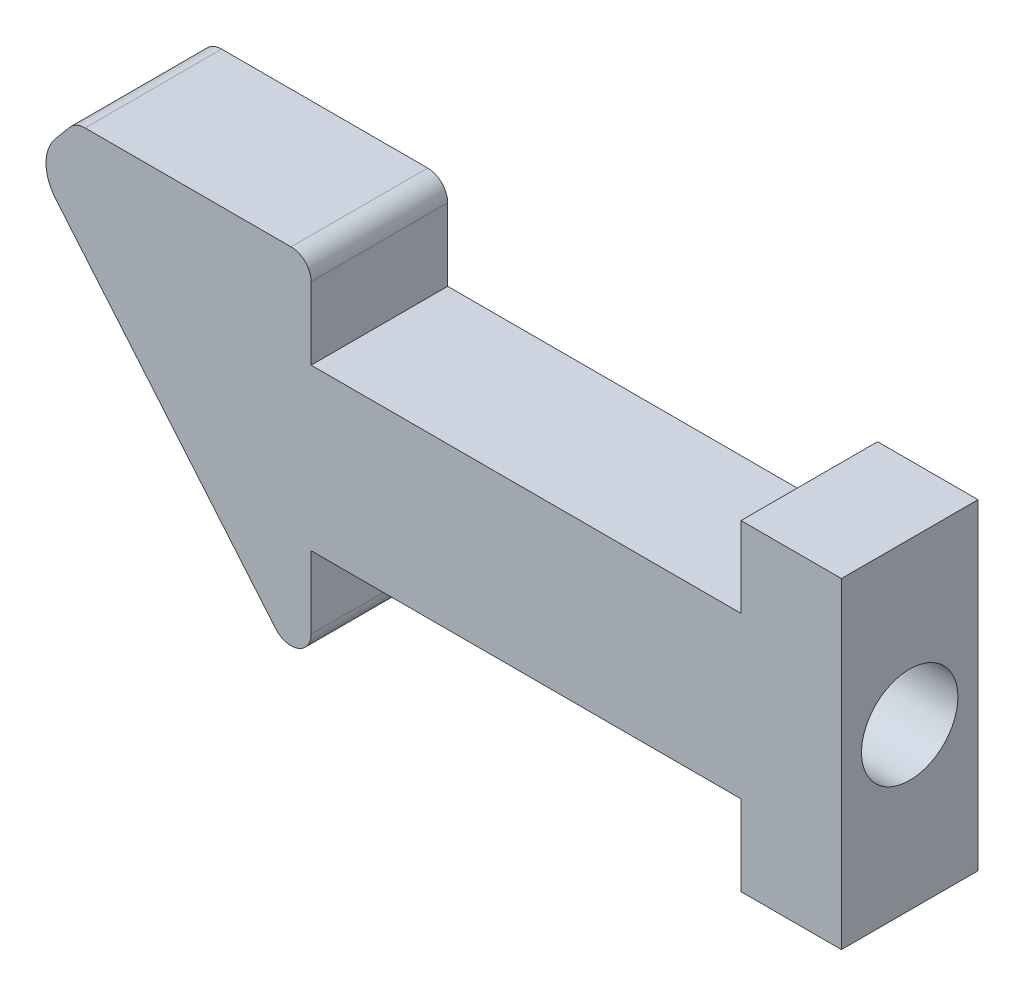
ISO-10303-21;
HEADER;
FILE_DESCRIPTION(('STEP AP214'),'2;1');
FILE_NAME('part.step','',(''),(''),'','','');
FILE_SCHEMA(('AUTOMOTIVE_DESIGN { 1 0 10303 214 1 1 1 1 }'));
ENDSEC;
DATA;
#1=APPLICATION_CONTEXT('core data for automotive mechanical design processes');
#2=APPLICATION_PROTOCOL_DEFINITION('international standard','automotive_design',2000,#1);
#3=PRODUCT_CONTEXT('',#1,'mechanical');
#4=PRODUCT('Part','Part','',(#3));
#5=PRODUCT_RELATED_PRODUCT_CATEGORY('part','',(#4));
#6=PRODUCT_DEFINITION_FORMATION('','',#4);
#7=PRODUCT_DEFINITION_CONTEXT('part definition',#1,'design');
#8=PRODUCT_DEFINITION('design','',#6,#7);
#9=PRODUCT_DEFINITION_SHAPE('','',#8);
#10=(LENGTH_UNIT() NAMED_UNIT(*) SI_UNIT(.MILLI.,.METRE.));
#11=(NAMED_UNIT(*) PLANE_ANGLE_UNIT() SI_UNIT($,.RADIAN.));
#12=(NAMED_UNIT(*) SI_UNIT($,.STERADIAN.) SOLID_ANGLE_UNIT());
#13=UNCERTAINTY_MEASURE_WITH_UNIT(LENGTH_MEASURE(1.E-05),#10,'distance_accuracy_value','');
#14=(GEOMETRIC_REPRESENTATION_CONTEXT(3) GLOBAL_UNCERTAINTY_ASSIGNED_CONTEXT((#13)) GLOBAL_UNIT_ASSIGNED_CONTEXT((#10,
#11,#12)) REPRESENTATION_CONTEXT('',''));
#15=CARTESIAN_POINT('',(0.,0.,0.));
#16=DIRECTION('',(0.,0.,1.));
#17=DIRECTION('',(1.,0.,0.));
#18=AXIS2_PLACEMENT_3D('',#15,#16,#17);
#19=CARTESIAN_POINT('',(-18.8,3.05580523566075,1.7));
#20=DIRECTION('',(0.,0.,-1.));
#21=DIRECTION('',(-1.,0.,0.));
#22=AXIS2_PLACEMENT_3D('',#19,#20,#21);
#23=CYLINDRICAL_SURFACE('',#22,1.);
#24=CARTESIAN_POINT('',(-18.8,3.05580523566075,-1.7));
#25=DIRECTION('',(0.,0.,1.));
#26=DIRECTION('',(-1.,0.,0.));
#27=AXIS2_PLACEMENT_3D('',#24,#25,#26);
#28=CIRCLE('',#27,1.);
#29=CARTESIAN_POINT('',(-19.566044443119,3.69859284534729,-1.7));
#30=VERTEX_POINT('',#29);
#31=CARTESIAN_POINT('',(-19.566044443119,2.41301762597422,-1.7));
#32=VERTEX_POINT('',#31);
#33=EDGE_CURVE('E178',#30,#32,#28,.T.);
#34=ORIENTED_EDGE('',*,*,#33,.T.);
#35=DIRECTION('',(0.,0.,-1.));
#36=VECTOR('',#35,1.);
#37=CARTESIAN_POINT('',(-19.566044443119,2.41301762597422,1.7));
#38=LINE('',#37,#36);
#39=CARTESIAN_POINT('',(-19.566044443119,2.41301762597422,1.7));
#40=VERTEX_POINT('',#39);
#41=EDGE_CURVE('E11',#40,#32,#38,.T.);
#42=ORIENTED_EDGE('',*,*,#41,.F.);
#43=CARTESIAN_POINT('',(-18.8,3.05580523566075,1.7));
#44=DIRECTION('',(0.,0.,1.));
#45=DIRECTION('',(-1.,0.,0.));
#46=AXIS2_PLACEMENT_3D('',#43,#44,#45);
#47=CIRCLE('',#46,1.);
#48=CARTESIAN_POINT('',(-19.566044443119,3.69859284534729,1.7));
#49=VERTEX_POINT('',#48);
#50=EDGE_CURVE('E209',#49,#40,#47,.T.);
#51=ORIENTED_EDGE('',*,*,#50,.F.);
#52=DIRECTION('',(0.,0.,-1.));
#53=VECTOR('',#52,1.);
#54=CARTESIAN_POINT('',(-19.566044443119,3.69859284534729,1.7));
#55=LINE('',#54,#53);
#56=EDGE_CURVE('E174',#49,#30,#55,.T.);
#57=ORIENTED_EDGE('',*,*,#56,.T.);
#58=EDGE_LOOP('',(#34,#42,#51,#57));
#59=FACE_BOUND('',#58,.T.);
#60=ADVANCED_FACE('F33',(#59),#23,.T.);
#61=CARTESIAN_POINT('',(-19.566044443119,2.41301762597422,1.7));
#62=DIRECTION('',(0.766044443118982,0.642787609686535,0.));
#63=DIRECTION('',(-0.642787609686535,0.766044443118982,0.));
#64=AXIS2_PLACEMENT_3D('',#61,#62,#63);
#65=PLANE('',#64);
#66=DIRECTION('',(0.642787609686535,-0.766044443118982,0.));
#67=VECTOR('',#66,1.);
#68=CARTESIAN_POINT('',(-19.566044443119,2.41301762597422,-1.7));
#69=LINE('',#68,#67);
#70=CARTESIAN_POINT('',(-14.0830222215595,-4.12139380484327,-1.7));
#71=VERTEX_POINT('',#70);
#72=EDGE_CURVE('E181',#32,#71,#69,.T.);
#73=ORIENTED_EDGE('',*,*,#72,.T.);
#74=DIRECTION('',(0.,0.,-1.));
#75=VECTOR('',#74,1.);
#76=CARTESIAN_POINT('',(-14.0830222215595,-4.12139380484327,1.7));
#77=LINE('',#76,#75);
#78=CARTESIAN_POINT('',(-14.0830222215595,-4.12139380484327,1.7));
#79=VERTEX_POINT('',#78);
#80=EDGE_CURVE('E42',#79,#71,#77,.T.);
#81=ORIENTED_EDGE('',*,*,#80,.F.);
#82=DIRECTION('',(0.642787609686535,-0.766044443118982,0.));
#83=VECTOR('',#82,1.);
#84=CARTESIAN_POINT('',(-19.566044443119,2.41301762597422,1.7));
#85=LINE('',#84,#83);
#86=EDGE_CURVE('E117',#40,#79,#85,.T.);
#87=ORIENTED_EDGE('',*,*,#86,.F.);
#88=ORIENTED_EDGE('',*,*,#41,.T.);
#89=EDGE_LOOP('',(#73,#81,#87,#88));
#90=FACE_BOUND('',#89,.T.);
#91=ADVANCED_FACE('F308',(#90),#65,.F.);
#92=CARTESIAN_POINT('',(-13.7,-3.8,1.7));
#93=DIRECTION('',(0.,0.,-1.));
#94=DIRECTION('',(-1.,0.,0.));
#95=AXIS2_PLACEMENT_3D('',#92,#93,#94);
#96=CYLINDRICAL_SURFACE('',#95,0.500000000000001);
#97=CARTESIAN_POINT('',(-13.7,-3.8,-1.7));
#98=DIRECTION('',(0.,0.,1.));
#99=DIRECTION('',(1.,0.,0.));
#100=AXIS2_PLACEMENT_3D('',#97,#98,#99);
#101=CIRCLE('',#100,0.500000000000001);
#102=CARTESIAN_POINT('',(-13.2,-3.8,-1.7));
#103=VERTEX_POINT('',#102);
#104=EDGE_CURVE('E184',#71,#103,#101,.T.);
#105=ORIENTED_EDGE('',*,*,#104,.T.);
#106=DIRECTION('',(0.,0.,-1.));
#107=VECTOR('',#106,1.);
#108=CARTESIAN_POINT('',(-13.2,-3.8,1.7));
#109=LINE('',#108,#107);
#110=CARTESIAN_POINT('',(-13.2,-3.8,1.7));
#111=VERTEX_POINT('',#110);
#112=EDGE_CURVE('E240',#111,#103,#109,.T.);
#113=ORIENTED_EDGE('',*,*,#112,.F.);
#114=CARTESIAN_POINT('',(-13.7,-3.8,1.7));
#115=DIRECTION('',(0.,0.,1.));
#116=DIRECTION('',(1.,0.,0.));
#117=AXIS2_PLACEMENT_3D('',#114,#115,#116);
#118=CIRCLE('',#117,0.500000000000001);
#119=EDGE_CURVE('E249',#79,#111,#118,.T.);
#120=ORIENTED_EDGE('',*,*,#119,.F.);
#121=ORIENTED_EDGE('',*,*,#80,.T.);
#122=EDGE_LOOP('',(#105,#113,#120,#121));
#123=FACE_BOUND('',#122,.T.);
#124=ADVANCED_FACE('F247',(#123),#96,.T.);
#125=CARTESIAN_POINT('',(-13.2,-3.8,1.7));
#126=DIRECTION('',(-1.,0.,0.));
#127=DIRECTION('',(0.,0.,1.));
#128=AXIS2_PLACEMENT_3D('',#125,#126,#127);
#129=PLANE('',#128);
#130=DIRECTION('',(0.,1.,0.));
#131=VECTOR('',#130,1.);
#132=CARTESIAN_POINT('',(-13.2,-3.8,-1.7));
#133=LINE('',#132,#131);
#134=CARTESIAN_POINT('',(-13.2,-2.,-1.7));
#135=VERTEX_POINT('',#134);
#136=EDGE_CURVE('E186',#103,#135,#133,.T.);
#137=ORIENTED_EDGE('',*,*,#136,.T.);
#138=DIRECTION('',(0.,0.,-1.));
#139=VECTOR('',#138,1.);
#140=CARTESIAN_POINT('',(-13.2,-2.,1.7));
#141=LINE('',#140,#139);
#142=CARTESIAN_POINT('',(-13.2,-2.,1.7));
#143=VERTEX_POINT('',#142);
#144=EDGE_CURVE('E237',#143,#135,#141,.T.);
#145=ORIENTED_EDGE('',*,*,#144,.F.);
#146=DIRECTION('',(0.,1.,0.));
#147=VECTOR('',#146,1.);
#148=CARTESIAN_POINT('',(-13.2,-3.8,1.7));
#149=LINE('',#148,#147);
#150=EDGE_CURVE('E267',#111,#143,#149,.T.);
#151=ORIENTED_EDGE('',*,*,#150,.F.);
#152=ORIENTED_EDGE('',*,*,#112,.T.);
#153=EDGE_LOOP('',(#137,#145,#151,#152));
#154=FACE_BOUND('',#153,.T.);
#155=ADVANCED_FACE('F258',(#154),#129,.F.);
#156=CARTESIAN_POINT('',(-13.2,-2.,1.7));
#157=DIRECTION('',(0.,1.,0.));
#158=DIRECTION('',(0.,0.,1.));
#159=AXIS2_PLACEMENT_3D('',#156,#157,#158);
#160=PLANE('',#159);
#161=DIRECTION('',(1.,0.,0.));
#162=VECTOR('',#161,1.);
#163=CARTESIAN_POINT('',(-13.2,-2.,-1.7));
#164=LINE('',#163,#162);
#165=CARTESIAN_POINT('',(-2.5,-2.,-1.7));
#166=VERTEX_POINT('',#165);
#167=EDGE_CURVE('E188',#135,#166,#164,.T.);
#168=ORIENTED_EDGE('',*,*,#167,.T.);
#169=DIRECTION('',(0.,0.,-1.));
#170=VECTOR('',#169,1.);
#171=CARTESIAN_POINT('',(-2.5,-2.,1.7));
#172=LINE('',#171,#170);
#173=CARTESIAN_POINT('',(-2.5,-2.,1.7));
#174=VERTEX_POINT('',#173);
#175=EDGE_CURVE('E234',#174,#166,#172,.T.);
#176=ORIENTED_EDGE('',*,*,#175,.F.);
#177=DIRECTION('',(1.,0.,0.));
#178=VECTOR('',#177,1.);
#179=CARTESIAN_POINT('',(-13.2,-2.,1.7));
#180=LINE('',#179,#178);
#181=EDGE_CURVE('E264',#143,#174,#180,.T.);
#182=ORIENTED_EDGE('',*,*,#181,.F.);
#183=ORIENTED_EDGE('',*,*,#144,.T.);
#184=EDGE_LOOP('',(#168,#176,#182,#183));
#185=FACE_BOUND('',#184,.T.);
#186=ADVANCED_FACE('F262',(#185),#160,.F.);
#187=CARTESIAN_POINT('',(-2.5,-4.,1.7));
#188=DIRECTION('',(1.,0.,0.));
#189=DIRECTION('',(0.,1.,0.));
#190=AXIS2_PLACEMENT_3D('',#187,#188,#189);
#191=PLANE('',#190);
#192=DIRECTION('',(0.,-1.,0.));
#193=VECTOR('',#192,1.);
#194=CARTESIAN_POINT('',(-2.5,-4.,-1.7));
#195=LINE('',#194,#193);
#196=CARTESIAN_POINT('',(-2.5,-4.,-1.7));
#197=VERTEX_POINT('',#196);
#198=EDGE_CURVE('E190',#166,#197,#195,.T.);
#199=ORIENTED_EDGE('',*,*,#198,.T.);
#200=DIRECTION('',(0.,0.,-1.));
#201=VECTOR('',#200,1.);
#202=CARTESIAN_POINT('',(-2.5,-4.,1.7));
#203=LINE('',#202,#201);
#204=CARTESIAN_POINT('',(-2.5,-4.,1.7));
#205=VERTEX_POINT('',#204);
#206=EDGE_CURVE('E231',#205,#197,#203,.T.);
#207=ORIENTED_EDGE('',*,*,#206,.F.);
#208=DIRECTION('',(0.,-1.,0.));
#209=VECTOR('',#208,1.);
#210=CARTESIAN_POINT('',(-2.5,-4.,1.7));
#211=LINE('',#210,#209);
#212=EDGE_CURVE('E266',#174,#205,#211,.T.);
#213=ORIENTED_EDGE('',*,*,#212,.F.);
#214=ORIENTED_EDGE('',*,*,#175,.T.);
#215=EDGE_LOOP('',(#199,#207,#213,#214));
#216=FACE_BOUND('',#215,.T.);
#217=ADVANCED_FACE('F321',(#216),#191,.F.);
#218=CARTESIAN_POINT('',(0.,-4.,1.7));
#219=DIRECTION('',(0.,1.,0.));
#220=DIRECTION('',(0.,0.,1.));
#221=AXIS2_PLACEMENT_3D('',#218,#219,#220);
#222=PLANE('',#221);
#223=DIRECTION('',(1.,0.,0.));
#224=VECTOR('',#223,1.);
#225=CARTESIAN_POINT('',(0.,-4.,-1.7));
#226=LINE('',#225,#224);
#227=CARTESIAN_POINT('',(0.,-4.,-1.7));
#228=VERTEX_POINT('',#227);
#229=EDGE_CURVE('E192',#197,#228,#226,.T.);
#230=ORIENTED_EDGE('',*,*,#229,.T.);
#231=DIRECTION('',(0.,0.,-1.));
#232=VECTOR('',#231,1.);
#233=CARTESIAN_POINT('',(0.,-4.,1.7));
#234=LINE('',#233,#232);
#235=CARTESIAN_POINT('',(0.,-4.,1.7));
#236=VERTEX_POINT('',#235);
#237=EDGE_CURVE('E228',#236,#228,#234,.T.);
#238=ORIENTED_EDGE('',*,*,#237,.F.);
#239=DIRECTION('',(1.,0.,0.));
#240=VECTOR('',#239,1.);
#241=CARTESIAN_POINT('',(0.,-4.,1.7));
#242=LINE('',#241,#240);
#243=EDGE_CURVE('E269',#205,#236,#242,.T.);
#244=ORIENTED_EDGE('',*,*,#243,.F.);
#245=ORIENTED_EDGE('',*,*,#206,.T.);
#246=EDGE_LOOP('',(#230,#238,#244,#245));
#247=FACE_BOUND('',#246,.T.);
#248=ADVANCED_FACE('F324',(#247),#222,.F.);
#249=CARTESIAN_POINT('',(0.,4.,1.7));
#250=DIRECTION('',(-1.,0.,0.));
#251=DIRECTION('',(0.,0.,1.));
#252=AXIS2_PLACEMENT_3D('',#249,#250,#251);
#253=PLANE('',#252);
#254=CARTESIAN_POINT('',(0.,0.,0.));
#255=DIRECTION('',(1.,0.,0.));
#256=DIRECTION('',(0.,0.,-1.));
#257=AXIS2_PLACEMENT_3D('',#254,#255,#256);
#258=CIRCLE('',#257,1.2);
#259=CARTESIAN_POINT('',(0.,0.,-1.2));
#260=VERTEX_POINT('',#259);
#261=EDGE_CURVE('E436',#260,#260,#258,.T.);
#262=ORIENTED_EDGE('',*,*,#261,.F.);
#263=EDGE_LOOP('',(#262));
#264=FACE_BOUND('',#263,.T.);
#265=DIRECTION('',(0.,1.,0.));
#266=VECTOR('',#265,1.);
#267=CARTESIAN_POINT('',(0.,4.,-1.7));
#268=LINE('',#267,#266);
#269=CARTESIAN_POINT('',(0.,4.,-1.7));
#270=VERTEX_POINT('',#269);
#271=EDGE_CURVE('E194',#228,#270,#268,.T.);
#272=ORIENTED_EDGE('',*,*,#271,.T.);
#273=DIRECTION('',(0.,0.,-1.));
#274=VECTOR('',#273,1.);
#275=CARTESIAN_POINT('',(0.,4.,1.7));
#276=LINE('',#275,#274);
#277=CARTESIAN_POINT('',(0.,4.,1.7));
#278=VERTEX_POINT('',#277);
#279=EDGE_CURVE('E225',#278,#270,#276,.T.);
#280=ORIENTED_EDGE('',*,*,#279,.F.);
#281=DIRECTION('',(0.,1.,0.));
#282=VECTOR('',#281,1.);
#283=CARTESIAN_POINT('',(0.,4.,1.7));
#284=LINE('',#283,#282);
#285=EDGE_CURVE('E275',#236,#278,#284,.T.);
#286=ORIENTED_EDGE('',*,*,#285,.F.);
#287=ORIENTED_EDGE('',*,*,#237,.T.);
#288=EDGE_LOOP('',(#272,#280,#286,#287));
#289=FACE_BOUND('',#288,.T.);
#290=ADVANCED_FACE('F328',(#264,#289),#253,.F.);
#291=CARTESIAN_POINT('',(-2.5,4.,1.7));
#292=DIRECTION('',(0.,-1.,0.));
#293=DIRECTION('',(0.,0.,-1.));
#294=AXIS2_PLACEMENT_3D('',#291,#292,#293);
#295=PLANE('',#294);
#296=DIRECTION('',(-1.,0.,0.));
#297=VECTOR('',#296,1.);
#298=CARTESIAN_POINT('',(-2.5,4.,-1.7));
#299=LINE('',#298,#297);
#300=CARTESIAN_POINT('',(-2.5,4.,-1.7));
#301=VERTEX_POINT('',#300);
#302=EDGE_CURVE('E196',#270,#301,#299,.T.);
#303=ORIENTED_EDGE('',*,*,#302,.T.);
#304=DIRECTION('',(0.,0.,-1.));
#305=VECTOR('',#304,1.);
#306=CARTESIAN_POINT('',(-2.5,4.,1.7));
#307=LINE('',#306,#305);
#308=CARTESIAN_POINT('',(-2.5,4.,1.7));
#309=VERTEX_POINT('',#308);
#310=EDGE_CURVE('E222',#309,#301,#307,.T.);
#311=ORIENTED_EDGE('',*,*,#310,.F.);
#312=DIRECTION('',(-1.,0.,0.));
#313=VECTOR('',#312,1.);
#314=CARTESIAN_POINT('',(-2.5,4.,1.7));
#315=LINE('',#314,#313);
#316=EDGE_CURVE('E277',#278,#309,#315,.T.);
#317=ORIENTED_EDGE('',*,*,#316,.F.);
#318=ORIENTED_EDGE('',*,*,#279,.T.);
#319=EDGE_LOOP('',(#303,#311,#317,#318));
#320=FACE_BOUND('',#319,.T.);
#321=ADVANCED_FACE('F332',(#320),#295,.F.);
#322=CARTESIAN_POINT('',(-2.5,2.,1.7));
#323=DIRECTION('',(1.,0.,0.));
#324=DIRECTION('',(0.,1.,0.));
#325=AXIS2_PLACEMENT_3D('',#322,#323,#324);
#326=PLANE('',#325);
#327=DIRECTION('',(0.,-1.,0.));
#328=VECTOR('',#327,1.);
#329=CARTESIAN_POINT('',(-2.5,2.,-1.7));
#330=LINE('',#329,#328);
#331=CARTESIAN_POINT('',(-2.5,2.,-1.7));
#332=VERTEX_POINT('',#331);
#333=EDGE_CURVE('E198',#301,#332,#330,.T.);
#334=ORIENTED_EDGE('',*,*,#333,.T.);
#335=DIRECTION('',(0.,0.,-1.));
#336=VECTOR('',#335,1.);
#337=CARTESIAN_POINT('',(-2.5,2.,1.7));
#338=LINE('',#337,#336);
#339=CARTESIAN_POINT('',(-2.5,2.,1.7));
#340=VERTEX_POINT('',#339);
#341=EDGE_CURVE('E219',#340,#332,#338,.T.);
#342=ORIENTED_EDGE('',*,*,#341,.F.);
#343=DIRECTION('',(0.,-1.,0.));
#344=VECTOR('',#343,1.);
#345=CARTESIAN_POINT('',(-2.5,2.,1.7));
#346=LINE('',#345,#344);
#347=EDGE_CURVE('E279',#309,#340,#346,.T.);
#348=ORIENTED_EDGE('',*,*,#347,.F.);
#349=ORIENTED_EDGE('',*,*,#310,.T.);
#350=EDGE_LOOP('',(#334,#342,#348,#349));
#351=FACE_BOUND('',#350,.T.);
#352=ADVANCED_FACE('F336',(#351),#326,.F.);
#353=CARTESIAN_POINT('',(-13.2,2.,1.7));
#354=DIRECTION('',(0.,-1.,0.));
#355=DIRECTION('',(0.,0.,-1.));
#356=AXIS2_PLACEMENT_3D('',#353,#354,#355);
#357=PLANE('',#356);
#358=DIRECTION('',(-1.,0.,0.));
#359=VECTOR('',#358,1.);
#360=CARTESIAN_POINT('',(-13.2,2.,-1.7));
#361=LINE('',#360,#359);
#362=CARTESIAN_POINT('',(-13.2,2.,-1.7));
#363=VERTEX_POINT('',#362);
#364=EDGE_CURVE('E200',#332,#363,#361,.T.);
#365=ORIENTED_EDGE('',*,*,#364,.T.);
#366=DIRECTION('',(0.,0.,-1.));
#367=VECTOR('',#366,1.);
#368=CARTESIAN_POINT('',(-13.2,2.,1.7));
#369=LINE('',#368,#367);
#370=CARTESIAN_POINT('',(-13.2,2.,1.7));
#371=VERTEX_POINT('',#370);
#372=EDGE_CURVE('E216',#371,#363,#369,.T.);
#373=ORIENTED_EDGE('',*,*,#372,.F.);
#374=DIRECTION('',(-1.,0.,0.));
#375=VECTOR('',#374,1.);
#376=CARTESIAN_POINT('',(-13.2,2.,1.7));
#377=LINE('',#376,#375);
#378=EDGE_CURVE('E281',#340,#371,#377,.T.);
#379=ORIENTED_EDGE('',*,*,#378,.F.);
#380=ORIENTED_EDGE('',*,*,#341,.T.);
#381=EDGE_LOOP('',(#365,#373,#379,#380));
#382=FACE_BOUND('',#381,.T.);
#383=ADVANCED_FACE('F340',(#382),#357,.F.);
#384=CARTESIAN_POINT('',(-13.2,2.,1.7));
#385=DIRECTION('',(-1.,0.,0.));
#386=DIRECTION('',(0.,-1.,0.));
#387=AXIS2_PLACEMENT_3D('',#384,#385,#386);
#388=PLANE('',#387);
#389=DIRECTION('',(0.,1.,0.));
#390=VECTOR('',#389,1.);
#391=CARTESIAN_POINT('',(-13.2,2.,-1.7));
#392=LINE('',#391,#390);
#393=CARTESIAN_POINT('',(-13.2,3.8,-1.7));
#394=VERTEX_POINT('',#393);
#395=EDGE_CURVE('E202',#363,#394,#392,.T.);
#396=ORIENTED_EDGE('',*,*,#395,.T.);
#397=DIRECTION('',(0.,0.,-1.));
#398=VECTOR('',#397,1.);
#399=CARTESIAN_POINT('',(-13.2,3.8,1.7));
#400=LINE('',#399,#398);
#401=CARTESIAN_POINT('',(-13.2,3.8,1.7));
#402=VERTEX_POINT('',#401);
#403=EDGE_CURVE('E213',#402,#394,#400,.T.);
#404=ORIENTED_EDGE('',*,*,#403,.F.);
#405=DIRECTION('',(0.,1.,0.));
#406=VECTOR('',#405,1.);
#407=CARTESIAN_POINT('',(-13.2,2.,1.7));
#408=LINE('',#407,#406);
#409=EDGE_CURVE('E283',#371,#402,#408,.T.);
#410=ORIENTED_EDGE('',*,*,#409,.F.);
#411=ORIENTED_EDGE('',*,*,#372,.T.);
#412=EDGE_LOOP('',(#396,#404,#410,#411));
#413=FACE_BOUND('',#412,.T.);
#414=ADVANCED_FACE('F289',(#413),#388,.F.);
#415=CARTESIAN_POINT('',(-13.7,3.8,1.7));
#416=DIRECTION('',(0.,0.,-1.));
#417=DIRECTION('',(-1.,0.,0.));
#418=AXIS2_PLACEMENT_3D('',#415,#416,#417);
#419=CYLINDRICAL_SURFACE('',#418,0.5);
#420=CARTESIAN_POINT('',(-13.7,3.8,-1.7));
#421=DIRECTION('',(0.,0.,1.));
#422=DIRECTION('',(1.,0.,0.));
#423=AXIS2_PLACEMENT_3D('',#420,#421,#422);
#424=CIRCLE('',#423,0.5);
#425=CARTESIAN_POINT('',(-13.7,4.3,-1.7));
#426=VERTEX_POINT('',#425);
#427=EDGE_CURVE('E204',#394,#426,#424,.T.);
#428=ORIENTED_EDGE('',*,*,#427,.T.);
#429=DIRECTION('',(0.,0.,-1.));
#430=VECTOR('',#429,1.);
#431=CARTESIAN_POINT('',(-13.7,4.3,1.7));
#432=LINE('',#431,#430);
#433=CARTESIAN_POINT('',(-13.7,4.3,1.7));
#434=VERTEX_POINT('',#433);
#435=EDGE_CURVE('E169',#434,#426,#432,.T.);
#436=ORIENTED_EDGE('',*,*,#435,.F.);
#437=CARTESIAN_POINT('',(-13.7,3.8,1.7));
#438=DIRECTION('',(0.,0.,1.));
#439=DIRECTION('',(1.,0.,0.));
#440=AXIS2_PLACEMENT_3D('',#437,#438,#439);
#441=CIRCLE('',#440,0.5);
#442=EDGE_CURVE('E160',#402,#434,#441,.T.);
#443=ORIENTED_EDGE('',*,*,#442,.F.);
#444=ORIENTED_EDGE('',*,*,#403,.T.);
#445=EDGE_LOOP('',(#428,#436,#443,#444));
#446=FACE_BOUND('',#445,.T.);
#447=ADVANCED_FACE('F293',(#446),#419,.T.);
#448=CARTESIAN_POINT('',(-18.828250092385,4.3,1.7));
#449=DIRECTION('',(0.,-1.,0.));
#450=DIRECTION('',(0.,0.,-1.));
#451=AXIS2_PLACEMENT_3D('',#448,#449,#450);
#452=PLANE('',#451);
#453=DIRECTION('',(-1.,0.,0.));
#454=VECTOR('',#453,1.);
#455=CARTESIAN_POINT('',(-18.828250092385,4.3,-1.7));
#456=LINE('',#455,#454);
#457=CARTESIAN_POINT('',(-18.828250092385,4.3,-1.7));
#458=VERTEX_POINT('',#457);
#459=EDGE_CURVE('E168',#426,#458,#456,.T.);
#460=ORIENTED_EDGE('',*,*,#459,.T.);
#461=DIRECTION('',(0.,0.,-1.));
#462=VECTOR('',#461,1.);
#463=CARTESIAN_POINT('',(-18.828250092385,4.3,1.7));
#464=LINE('',#463,#462);
#465=CARTESIAN_POINT('',(-18.828250092385,4.3,1.7));
#466=VERTEX_POINT('',#465);
#467=EDGE_CURVE('E165',#466,#458,#464,.T.);
#468=ORIENTED_EDGE('',*,*,#467,.F.);
#469=DIRECTION('',(-1.,0.,0.));
#470=VECTOR('',#469,1.);
#471=CARTESIAN_POINT('',(-18.828250092385,4.3,1.7));
#472=LINE('',#471,#470);
#473=EDGE_CURVE('E154',#434,#466,#472,.T.);
#474=ORIENTED_EDGE('',*,*,#473,.F.);
#475=ORIENTED_EDGE('',*,*,#435,.T.);
#476=EDGE_LOOP('',(#460,#468,#474,#475));
#477=FACE_BOUND('',#476,.T.);
#478=ADVANCED_FACE('F166',(#477),#452,.F.);
#479=CARTESIAN_POINT('',(-18.828250092385,3.8,1.7));
#480=DIRECTION('',(0.,0.,-1.));
#481=DIRECTION('',(-1.,0.,0.));
#482=AXIS2_PLACEMENT_3D('',#479,#480,#481);
#483=CYLINDRICAL_SURFACE('',#482,0.499999999999999);
#484=CARTESIAN_POINT('',(-18.828250092385,3.8,-1.7));
#485=DIRECTION('',(0.,0.,1.));
#486=DIRECTION('',(1.,0.,0.));
#487=AXIS2_PLACEMENT_3D('',#484,#485,#486);
#488=CIRCLE('',#487,0.499999999999999);
#489=CARTESIAN_POINT('',(-19.2112723139445,4.12139380484327,-1.7));
#490=VERTEX_POINT('',#489);
#491=EDGE_CURVE('E103',#458,#490,#488,.T.);
#492=ORIENTED_EDGE('',*,*,#491,.T.);
#493=DIRECTION('',(0.,0.,-1.));
#494=VECTOR('',#493,1.);
#495=CARTESIAN_POINT('',(-19.2112723139445,4.12139380484327,1.7));
#496=LINE('',#495,#494);
#497=CARTESIAN_POINT('',(-19.2112723139445,4.12139380484327,1.7));
#498=VERTEX_POINT('',#497);
#499=EDGE_CURVE('E170',#498,#490,#496,.T.);
#500=ORIENTED_EDGE('',*,*,#499,.F.);
#501=CARTESIAN_POINT('',(-18.828250092385,3.8,1.7));
#502=DIRECTION('',(0.,0.,1.));
#503=DIRECTION('',(1.,0.,0.));
#504=AXIS2_PLACEMENT_3D('',#501,#502,#503);
#505=CIRCLE('',#504,0.499999999999999);
#506=EDGE_CURVE('E158',#466,#498,#505,.T.);
#507=ORIENTED_EDGE('',*,*,#506,.F.);
#508=ORIENTED_EDGE('',*,*,#467,.T.);
#509=EDGE_LOOP('',(#492,#500,#507,#508));
#510=FACE_BOUND('',#509,.T.);
#511=ADVANCED_FACE('F172',(#510),#483,.T.);
#512=CARTESIAN_POINT('',(-19.566044443119,3.69859284534729,1.7));
#513=DIRECTION('',(0.766044443118979,-0.642787609686538,0.));
#514=DIRECTION('',(0.642787609686538,0.766044443118979,0.));
#515=AXIS2_PLACEMENT_3D('',#512,#513,#514);
#516=PLANE('',#515);
#517=DIRECTION('',(-0.642787609686538,-0.766044443118979,0.));
#518=VECTOR('',#517,1.);
#519=CARTESIAN_POINT('',(-19.566044443119,3.69859284534729,-1.7));
#520=LINE('',#519,#518);
#521=EDGE_CURVE('E109',#490,#30,#520,.T.);
#522=ORIENTED_EDGE('',*,*,#521,.T.);
#523=ORIENTED_EDGE('',*,*,#56,.F.);
#524=DIRECTION('',(-0.642787609686538,-0.766044443118979,0.));
#525=VECTOR('',#524,1.);
#526=CARTESIAN_POINT('',(-19.566044443119,3.69859284534729,1.7));
#527=LINE('',#526,#525);
#528=EDGE_CURVE('E50',#498,#49,#527,.T.);
#529=ORIENTED_EDGE('',*,*,#528,.F.);
#530=ORIENTED_EDGE('',*,*,#499,.T.);
#531=EDGE_LOOP('',(#522,#523,#529,#530));
#532=FACE_BOUND('',#531,.T.);
#533=ADVANCED_FACE('F297',(#532),#516,.F.);
#534=CARTESIAN_POINT('',(-18.8,3.05580523566075,1.7));
#535=DIRECTION('',(0.,0.,-1.));
#536=DIRECTION('',(-1.,0.,0.));
#537=AXIS2_PLACEMENT_3D('',#534,#535,#536);
#538=PLANE('',#537);
#539=ORIENTED_EDGE('',*,*,#50,.T.);
#540=ORIENTED_EDGE('',*,*,#86,.T.);
#541=ORIENTED_EDGE('',*,*,#119,.T.);
#542=ORIENTED_EDGE('',*,*,#150,.T.);
#543=ORIENTED_EDGE('',*,*,#181,.T.);
#544=ORIENTED_EDGE('',*,*,#212,.T.);
#545=ORIENTED_EDGE('',*,*,#243,.T.);
#546=ORIENTED_EDGE('',*,*,#285,.T.);
#547=ORIENTED_EDGE('',*,*,#316,.T.);
#548=ORIENTED_EDGE('',*,*,#347,.T.);
#549=ORIENTED_EDGE('',*,*,#378,.T.);
#550=ORIENTED_EDGE('',*,*,#409,.T.);
#551=ORIENTED_EDGE('',*,*,#442,.T.);
#552=ORIENTED_EDGE('',*,*,#473,.T.);
#553=ORIENTED_EDGE('',*,*,#506,.T.);
#554=ORIENTED_EDGE('',*,*,#528,.T.);
#555=EDGE_LOOP('',(#539,#540,#541,#542,#543,#544,#545,#546,#547,#548,#549,#550,#551,#552,#553,#554));
#556=FACE_BOUND('',#555,.T.);
#557=ADVANCED_FACE('F156',(#556),#538,.F.);
#558=CARTESIAN_POINT('',(-18.8,3.05580523566075,-1.7));
#559=DIRECTION('',(0.,0.,-1.));
#560=DIRECTION('',(-1.,0.,0.));
#561=AXIS2_PLACEMENT_3D('',#558,#559,#560);
#562=PLANE('',#561);
#563=ORIENTED_EDGE('',*,*,#33,.F.);
#564=ORIENTED_EDGE('',*,*,#521,.F.);
#565=ORIENTED_EDGE('',*,*,#491,.F.);
#566=ORIENTED_EDGE('',*,*,#459,.F.);
#567=ORIENTED_EDGE('',*,*,#427,.F.);
#568=ORIENTED_EDGE('',*,*,#395,.F.);
#569=ORIENTED_EDGE('',*,*,#364,.F.);
#570=ORIENTED_EDGE('',*,*,#333,.F.);
#571=ORIENTED_EDGE('',*,*,#302,.F.);
#572=ORIENTED_EDGE('',*,*,#271,.F.);
#573=ORIENTED_EDGE('',*,*,#229,.F.);
#574=ORIENTED_EDGE('',*,*,#198,.F.);
#575=ORIENTED_EDGE('',*,*,#167,.F.);
#576=ORIENTED_EDGE('',*,*,#136,.F.);
#577=ORIENTED_EDGE('',*,*,#104,.F.);
#578=ORIENTED_EDGE('',*,*,#72,.F.);
#579=EDGE_LOOP('',(#563,#564,#565,#566,#567,#568,#569,#570,#571,#572,#573,#574,#575,#576,#577,#578));
#580=FACE_BOUND('',#579,.T.);
#581=ADVANCED_FACE('F253',(#580),#562,.T.);
#582=CARTESIAN_POINT('',(-2.8,0.,0.));
#583=DIRECTION('',(1.,0.,0.));
#584=DIRECTION('',(0.,0.,-1.));
#585=AXIS2_PLACEMENT_3D('',#582,#583,#584);
#586=PLANE('',#585);
#587=CARTESIAN_POINT('',(-2.8,0.,0.));
#588=DIRECTION('',(1.,0.,0.));
#589=DIRECTION('',(0.,0.,-1.));
#590=AXIS2_PLACEMENT_3D('',#587,#588,#589);
#591=CIRCLE('',#590,1.2);
#592=CARTESIAN_POINT('',(-2.8,0.,-1.2));
#593=VERTEX_POINT('',#592);
#594=EDGE_CURVE('E433',#593,#593,#591,.T.);
#595=ORIENTED_EDGE('',*,*,#594,.T.);
#596=EDGE_LOOP('',(#595));
#597=FACE_BOUND('',#596,.T.);
#598=CARTESIAN_POINT('',(-2.8,0.,0.));
#599=DIRECTION('',(1.,0.,0.));
#600=DIRECTION('',(0.,0.,-1.));
#601=AXIS2_PLACEMENT_3D('',#598,#599,#600);
#602=CIRCLE('',#601,0.95);
#603=CARTESIAN_POINT('',(-2.8,0.,-0.95));
#604=VERTEX_POINT('',#603);
#605=EDGE_CURVE('E36',#604,#604,#602,.F.);
#606=ORIENTED_EDGE('',*,*,#605,.T.);
#607=EDGE_LOOP('',(#606));
#608=FACE_BOUND('',#607,.T.);
#609=ADVANCED_FACE('F377',(#597,#608),#586,.T.);
#610=CARTESIAN_POINT('',(-2.8,0.,0.));
#611=DIRECTION('',(1.,0.,0.));
#612=DIRECTION('',(0.,0.,-1.));
#613=AXIS2_PLACEMENT_3D('',#610,#611,#612);
#614=CYLINDRICAL_SURFACE('',#613,1.2);
#615=ORIENTED_EDGE('',*,*,#594,.F.);
#616=EDGE_LOOP('',(#615));
#617=FACE_BOUND('',#616,.T.);
#618=ORIENTED_EDGE('',*,*,#261,.T.);
#619=EDGE_LOOP('',(#618));
#620=FACE_BOUND('',#619,.T.);
#621=ADVANCED_FACE('F388',(#617,#620),#614,.F.);
#622=CARTESIAN_POINT('',(-9.5,0.,0.));
#623=DIRECTION('',(1.,0.,0.));
#624=DIRECTION('',(0.,0.,-1.));
#625=AXIS2_PLACEMENT_3D('',#622,#623,#624);
#626=PLANE('',#625);
#627=CARTESIAN_POINT('',(-9.5,0.,0.));
#628=DIRECTION('',(1.,0.,0.));
#629=DIRECTION('',(0.,0.,-1.));
#630=AXIS2_PLACEMENT_3D('',#627,#628,#629);
#631=CIRCLE('',#630,0.95);
#632=CARTESIAN_POINT('',(-9.5,0.,-0.95));
#633=VERTEX_POINT('',#632);
#634=EDGE_CURVE('E182',#633,#633,#631,.T.);
#635=ORIENTED_EDGE('',*,*,#634,.T.);
#636=EDGE_LOOP('',(#635));
#637=FACE_BOUND('',#636,.T.);
#638=ADVANCED_FACE('F383',(#637),#626,.T.);
#639=CARTESIAN_POINT('',(-9.5,0.,0.));
#640=DIRECTION('',(1.,0.,0.));
#641=DIRECTION('',(0.,0.,-1.));
#642=AXIS2_PLACEMENT_3D('',#639,#640,#641);
#643=CYLINDRICAL_SURFACE('',#642,0.95);
#644=ORIENTED_EDGE('',*,*,#634,.F.);
#645=EDGE_LOOP('',(#644));
#646=FACE_BOUND('',#645,.T.);
#647=ORIENTED_EDGE('',*,*,#605,.F.);
#648=EDGE_LOOP('',(#647));
#649=FACE_BOUND('',#648,.T.);
#650=ADVANCED_FACE('F387',(#646,#649),#643,.F.);
#651=CLOSED_SHELL('',(#60,#91,#124,#155,#186,#217,#248,#290,#321,#352,#383,#414,#447,#478,#511,
#533,#557,#581,#609,#621,#638,#650));
#652=MANIFOLD_SOLID_BREP('B2',#651);
#653=ADVANCED_BREP_SHAPE_REPRESENTATION('',(#18,#652),#14);
#654=SHAPE_DEFINITION_REPRESENTATION(#9,#653);
ENDSEC;
END-ISO-10303-21;
